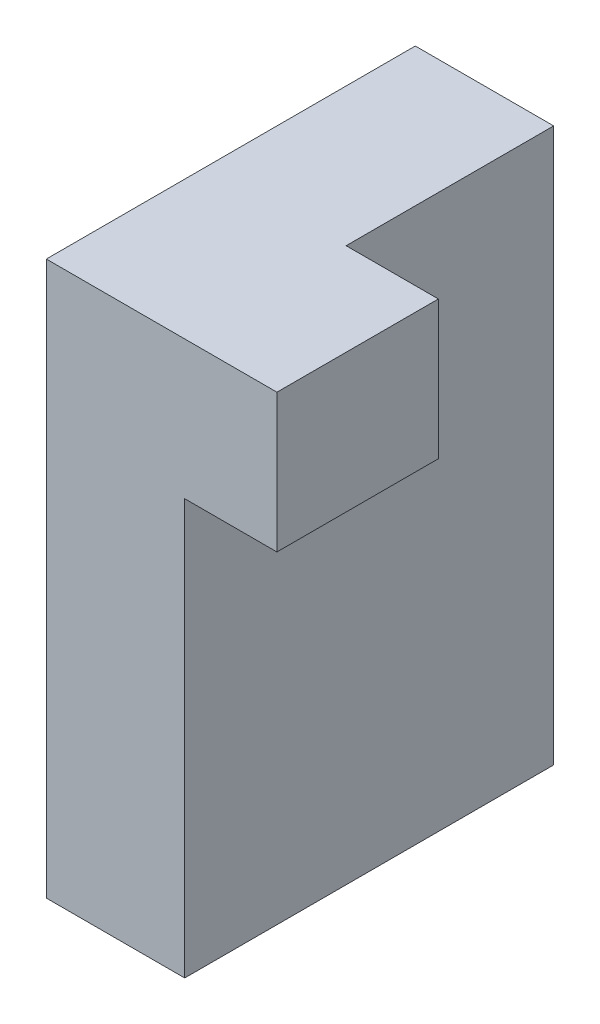
ISO-10303-21;
HEADER;
FILE_DESCRIPTION(('STEP AP214'),'2;1');
FILE_NAME('part.step','',(''),(''),'','','');
FILE_SCHEMA(('AUTOMOTIVE_DESIGN { 1 0 10303 214 1 1 1 1 }'));
ENDSEC;
DATA;
#1=APPLICATION_CONTEXT('core data for automotive mechanical design processes');
#2=APPLICATION_PROTOCOL_DEFINITION('international standard','automotive_design',2000,#1);
#3=PRODUCT_CONTEXT('',#1,'mechanical');
#4=PRODUCT('Part','Part','',(#3));
#5=PRODUCT_RELATED_PRODUCT_CATEGORY('part','',(#4));
#6=PRODUCT_DEFINITION_FORMATION('','',#4);
#7=PRODUCT_DEFINITION_CONTEXT('part definition',#1,'design');
#8=PRODUCT_DEFINITION('design','',#6,#7);
#9=PRODUCT_DEFINITION_SHAPE('','',#8);
#10=(LENGTH_UNIT() NAMED_UNIT(*) SI_UNIT(.MILLI.,.METRE.));
#11=(NAMED_UNIT(*) PLANE_ANGLE_UNIT() SI_UNIT($,.RADIAN.));
#12=(NAMED_UNIT(*) SI_UNIT($,.STERADIAN.) SOLID_ANGLE_UNIT());
#13=UNCERTAINTY_MEASURE_WITH_UNIT(LENGTH_MEASURE(1.E-05),#10,'distance_accuracy_value','');
#14=(GEOMETRIC_REPRESENTATION_CONTEXT(3) GLOBAL_UNCERTAINTY_ASSIGNED_CONTEXT((#13)) GLOBAL_UNIT_ASSIGNED_CONTEXT((#10,
#11,#12)) REPRESENTATION_CONTEXT('',''));
#15=CARTESIAN_POINT('',(0.,0.,0.));
#16=DIRECTION('',(0.,0.,1.));
#17=DIRECTION('',(1.,0.,0.));
#18=AXIS2_PLACEMENT_3D('',#15,#16,#17);
#19=CARTESIAN_POINT('',(9.525,38.1,25.4));
#20=DIRECTION('',(0.,0.,-1.));
#21=DIRECTION('',(0.,1.,0.));
#22=AXIS2_PLACEMENT_3D('',#19,#20,#21);
#23=PLANE('',#22);
#24=DIRECTION('',(0.,-1.,0.));
#25=VECTOR('',#24,1.);
#26=CARTESIAN_POINT('',(-9.525,38.1,25.4));
#27=LINE('',#26,#25);
#28=CARTESIAN_POINT('',(-9.525,38.1,25.4));
#29=VERTEX_POINT('',#28);
#30=CARTESIAN_POINT('',(-9.525,-38.1,25.4));
#31=VERTEX_POINT('',#30);
#32=EDGE_CURVE('E116',#29,#31,#27,.T.);
#33=ORIENTED_EDGE('',*,*,#32,.T.);
#34=DIRECTION('',(-1.,0.,0.));
#35=VECTOR('',#34,1.);
#36=CARTESIAN_POINT('',(9.525,-38.1,25.4));
#37=LINE('',#36,#35);
#38=CARTESIAN_POINT('',(9.525,-38.1,25.4));
#39=VERTEX_POINT('',#38);
#40=EDGE_CURVE('E11',#39,#31,#37,.T.);
#41=ORIENTED_EDGE('',*,*,#40,.F.);
#42=DIRECTION('',(0.,-1.,0.));
#43=VECTOR('',#42,1.);
#44=CARTESIAN_POINT('',(9.525,38.1,25.4));
#45=LINE('',#44,#43);
#46=CARTESIAN_POINT('',(9.525,19.05,25.4));
#47=VERTEX_POINT('',#46);
#48=EDGE_CURVE('E115',#47,#39,#45,.T.);
#49=ORIENTED_EDGE('',*,*,#48,.F.);
#50=DIRECTION('',(-1.,0.,0.));
#51=VECTOR('',#50,1.);
#52=CARTESIAN_POINT('',(22.225,19.05,25.4));
#53=LINE('',#52,#51);
#54=CARTESIAN_POINT('',(22.225,19.05,25.4));
#55=VERTEX_POINT('',#54);
#56=EDGE_CURVE('E96',#55,#47,#53,.T.);
#57=ORIENTED_EDGE('',*,*,#56,.F.);
#58=DIRECTION('',(0.,-1.,0.));
#59=VECTOR('',#58,1.);
#60=CARTESIAN_POINT('',(22.225,38.1,25.4));
#61=LINE('',#60,#59);
#62=CARTESIAN_POINT('',(22.225,38.1,25.4));
#63=VERTEX_POINT('',#62);
#64=EDGE_CURVE('E102',#63,#55,#61,.T.);
#65=ORIENTED_EDGE('',*,*,#64,.F.);
#66=DIRECTION('',(-1.,0.,0.));
#67=VECTOR('',#66,1.);
#68=CARTESIAN_POINT('',(9.525,38.1,25.4));
#69=LINE('',#68,#67);
#70=EDGE_CURVE('E142',#63,#29,#69,.T.);
#71=ORIENTED_EDGE('',*,*,#70,.T.);
#72=EDGE_LOOP('',(#33,#41,#49,#57,#65,#71));
#73=FACE_BOUND('',#72,.T.);
#74=ADVANCED_FACE('F33',(#73),#23,.F.);
#75=CARTESIAN_POINT('',(9.525,-38.1,25.4));
#76=DIRECTION('',(0.,1.,0.));
#77=DIRECTION('',(0.,0.,1.));
#78=AXIS2_PLACEMENT_3D('',#75,#76,#77);
#79=PLANE('',#78);
#80=DIRECTION('',(0.,0.,-1.));
#81=VECTOR('',#80,1.);
#82=CARTESIAN_POINT('',(-9.525,-38.1,25.4));
#83=LINE('',#82,#81);
#84=CARTESIAN_POINT('',(-9.525,-38.1,-25.4));
#85=VERTEX_POINT('',#84);
#86=EDGE_CURVE('E118',#31,#85,#83,.T.);
#87=ORIENTED_EDGE('',*,*,#86,.T.);
#88=DIRECTION('',(-1.,0.,0.));
#89=VECTOR('',#88,1.);
#90=CARTESIAN_POINT('',(9.525,-38.1,-25.4));
#91=LINE('',#90,#89);
#92=CARTESIAN_POINT('',(9.525,-38.1,-25.4));
#93=VERTEX_POINT('',#92);
#94=EDGE_CURVE('E41',#93,#85,#91,.T.);
#95=ORIENTED_EDGE('',*,*,#94,.F.);
#96=DIRECTION('',(0.,0.,-1.));
#97=VECTOR('',#96,1.);
#98=CARTESIAN_POINT('',(9.525,-38.1,25.4));
#99=LINE('',#98,#97);
#100=EDGE_CURVE('E135',#39,#93,#99,.T.);
#101=ORIENTED_EDGE('',*,*,#100,.F.);
#102=ORIENTED_EDGE('',*,*,#40,.T.);
#103=EDGE_LOOP('',(#87,#95,#101,#102));
#104=FACE_BOUND('',#103,.T.);
#105=ADVANCED_FACE('F168',(#104),#79,.F.);
#106=CARTESIAN_POINT('',(9.525,38.1,-25.4));
#107=DIRECTION('',(0.,0.,1.));
#108=DIRECTION('',(0.,-1.,0.));
#109=AXIS2_PLACEMENT_3D('',#106,#107,#108);
#110=PLANE('',#109);
#111=DIRECTION('',(0.,1.,0.));
#112=VECTOR('',#111,1.);
#113=CARTESIAN_POINT('',(-9.525,38.1,-25.4));
#114=LINE('',#113,#112);
#115=CARTESIAN_POINT('',(-9.525,38.1,-25.4));
#116=VERTEX_POINT('',#115);
#117=EDGE_CURVE('E147',#85,#116,#114,.T.);
#118=ORIENTED_EDGE('',*,*,#117,.T.);
#119=DIRECTION('',(-1.,0.,0.));
#120=VECTOR('',#119,1.);
#121=CARTESIAN_POINT('',(9.525,38.1,-25.4));
#122=LINE('',#121,#120);
#123=CARTESIAN_POINT('',(9.525,38.1,-25.4));
#124=VERTEX_POINT('',#123);
#125=EDGE_CURVE('E151',#124,#116,#122,.T.);
#126=ORIENTED_EDGE('',*,*,#125,.F.);
#127=DIRECTION('',(0.,1.,0.));
#128=VECTOR('',#127,1.);
#129=CARTESIAN_POINT('',(9.525,38.1,-25.4));
#130=LINE('',#129,#128);
#131=EDGE_CURVE('E143',#93,#124,#130,.T.);
#132=ORIENTED_EDGE('',*,*,#131,.F.);
#133=ORIENTED_EDGE('',*,*,#94,.T.);
#134=EDGE_LOOP('',(#118,#126,#132,#133));
#135=FACE_BOUND('',#134,.T.);
#136=ADVANCED_FACE('F158',(#135),#110,.F.);
#137=CARTESIAN_POINT('',(9.525,38.1,25.4));
#138=DIRECTION('',(0.,-1.,0.));
#139=DIRECTION('',(0.,0.,-1.));
#140=AXIS2_PLACEMENT_3D('',#137,#138,#139);
#141=PLANE('',#140);
#142=DIRECTION('',(0.,0.,1.));
#143=VECTOR('',#142,1.);
#144=CARTESIAN_POINT('',(-9.525,38.1,25.4));
#145=LINE('',#144,#143);
#146=EDGE_CURVE('E139',#116,#29,#145,.T.);
#147=ORIENTED_EDGE('',*,*,#146,.T.);
#148=ORIENTED_EDGE('',*,*,#70,.F.);
#149=DIRECTION('',(0.,0.,1.));
#150=VECTOR('',#149,1.);
#151=CARTESIAN_POINT('',(22.225,38.1,25.4));
#152=LINE('',#151,#150);
#153=CARTESIAN_POINT('',(22.225,38.1,3.175));
#154=VERTEX_POINT('',#153);
#155=EDGE_CURVE('E108',#154,#63,#152,.T.);
#156=ORIENTED_EDGE('',*,*,#155,.F.);
#157=DIRECTION('',(-1.,0.,0.));
#158=VECTOR('',#157,1.);
#159=CARTESIAN_POINT('',(22.225,38.1,3.175));
#160=LINE('',#159,#158);
#161=CARTESIAN_POINT('',(9.525,38.1,3.175));
#162=VERTEX_POINT('',#161);
#163=EDGE_CURVE('E120',#154,#162,#160,.T.);
#164=ORIENTED_EDGE('',*,*,#163,.T.);
#165=DIRECTION('',(0.,0.,1.));
#166=VECTOR('',#165,1.);
#167=CARTESIAN_POINT('',(9.525,38.1,25.4));
#168=LINE('',#167,#166);
#169=EDGE_CURVE('E49',#124,#162,#168,.T.);
#170=ORIENTED_EDGE('',*,*,#169,.F.);
#171=ORIENTED_EDGE('',*,*,#125,.T.);
#172=EDGE_LOOP('',(#147,#148,#156,#164,#170,#171));
#173=FACE_BOUND('',#172,.T.);
#174=ADVANCED_FACE('F167',(#173),#141,.F.);
#175=CARTESIAN_POINT('',(9.525,0.,0.));
#176=DIRECTION('',(1.,0.,0.));
#177=DIRECTION('',(0.,0.,-1.));
#178=AXIS2_PLACEMENT_3D('',#175,#176,#177);
#179=PLANE('',#178);
#180=DIRECTION('',(0.,1.,0.));
#181=VECTOR('',#180,1.);
#182=CARTESIAN_POINT('',(9.525,38.1,3.175));
#183=LINE('',#182,#181);
#184=CARTESIAN_POINT('',(9.525,19.05,3.175));
#185=VERTEX_POINT('',#184);
#186=EDGE_CURVE('E111',#185,#162,#183,.T.);
#187=ORIENTED_EDGE('',*,*,#186,.F.);
#188=DIRECTION('',(0.,0.,-1.));
#189=VECTOR('',#188,1.);
#190=CARTESIAN_POINT('',(9.525,19.05,25.4));
#191=LINE('',#190,#189);
#192=EDGE_CURVE('E55',#47,#185,#191,.T.);
#193=ORIENTED_EDGE('',*,*,#192,.F.);
#194=ORIENTED_EDGE('',*,*,#48,.T.);
#195=ORIENTED_EDGE('',*,*,#100,.T.);
#196=ORIENTED_EDGE('',*,*,#131,.T.);
#197=ORIENTED_EDGE('',*,*,#169,.T.);
#198=EDGE_LOOP('',(#187,#193,#194,#195,#196,#197));
#199=FACE_BOUND('',#198,.T.);
#200=ADVANCED_FACE('F169',(#199),#179,.T.);
#201=CARTESIAN_POINT('',(-9.525,0.,0.));
#202=DIRECTION('',(1.,0.,0.));
#203=DIRECTION('',(0.,0.,-1.));
#204=AXIS2_PLACEMENT_3D('',#201,#202,#203);
#205=PLANE('',#204);
#206=ORIENTED_EDGE('',*,*,#32,.F.);
#207=ORIENTED_EDGE('',*,*,#146,.F.);
#208=ORIENTED_EDGE('',*,*,#117,.F.);
#209=ORIENTED_EDGE('',*,*,#86,.F.);
#210=EDGE_LOOP('',(#206,#207,#208,#209));
#211=FACE_BOUND('',#210,.T.);
#212=ADVANCED_FACE('F165',(#211),#205,.F.);
#213=CARTESIAN_POINT('',(22.225,19.05,25.4));
#214=DIRECTION('',(0.,1.,0.));
#215=DIRECTION('',(0.,0.,1.));
#216=AXIS2_PLACEMENT_3D('',#213,#214,#215);
#217=PLANE('',#216);
#218=ORIENTED_EDGE('',*,*,#192,.T.);
#219=DIRECTION('',(-1.,0.,0.));
#220=VECTOR('',#219,1.);
#221=CARTESIAN_POINT('',(22.225,19.05,3.175));
#222=LINE('',#221,#220);
#223=CARTESIAN_POINT('',(22.225,19.05,3.175));
#224=VERTEX_POINT('',#223);
#225=EDGE_CURVE('E98',#224,#185,#222,.T.);
#226=ORIENTED_EDGE('',*,*,#225,.F.);
#227=DIRECTION('',(0.,0.,-1.));
#228=VECTOR('',#227,1.);
#229=CARTESIAN_POINT('',(22.225,19.05,25.4));
#230=LINE('',#229,#228);
#231=EDGE_CURVE('E92',#55,#224,#230,.T.);
#232=ORIENTED_EDGE('',*,*,#231,.F.);
#233=ORIENTED_EDGE('',*,*,#56,.T.);
#234=EDGE_LOOP('',(#218,#226,#232,#233));
#235=FACE_BOUND('',#234,.T.);
#236=ADVANCED_FACE('F94',(#235),#217,.F.);
#237=CARTESIAN_POINT('',(22.225,38.1,3.175));
#238=DIRECTION('',(0.,0.,1.));
#239=DIRECTION('',(0.,-1.,0.));
#240=AXIS2_PLACEMENT_3D('',#237,#238,#239);
#241=PLANE('',#240);
#242=ORIENTED_EDGE('',*,*,#186,.T.);
#243=ORIENTED_EDGE('',*,*,#163,.F.);
#244=DIRECTION('',(0.,1.,0.));
#245=VECTOR('',#244,1.);
#246=CARTESIAN_POINT('',(22.225,38.1,3.175));
#247=LINE('',#246,#245);
#248=EDGE_CURVE('E101',#224,#154,#247,.T.);
#249=ORIENTED_EDGE('',*,*,#248,.F.);
#250=ORIENTED_EDGE('',*,*,#225,.T.);
#251=EDGE_LOOP('',(#242,#243,#249,#250));
#252=FACE_BOUND('',#251,.T.);
#253=ADVANCED_FACE('F173',(#252),#241,.F.);
#254=CARTESIAN_POINT('',(22.225,0.,0.));
#255=DIRECTION('',(1.,0.,0.));
#256=DIRECTION('',(0.,0.,-1.));
#257=AXIS2_PLACEMENT_3D('',#254,#255,#256);
#258=PLANE('',#257);
#259=ORIENTED_EDGE('',*,*,#64,.T.);
#260=ORIENTED_EDGE('',*,*,#231,.T.);
#261=ORIENTED_EDGE('',*,*,#248,.T.);
#262=ORIENTED_EDGE('',*,*,#155,.T.);
#263=EDGE_LOOP('',(#259,#260,#261,#262));
#264=FACE_BOUND('',#263,.T.);
#265=ADVANCED_FACE('F106',(#264),#258,.T.);
#266=CLOSED_SHELL('',(#74,#105,#136,#174,#200,#212,#236,#253,#265));
#267=MANIFOLD_SOLID_BREP('B2',#266);
#268=ADVANCED_BREP_SHAPE_REPRESENTATION('',(#18,#267),#14);
#269=SHAPE_DEFINITION_REPRESENTATION(#9,#268);
ENDSEC;
END-ISO-10303-21;
